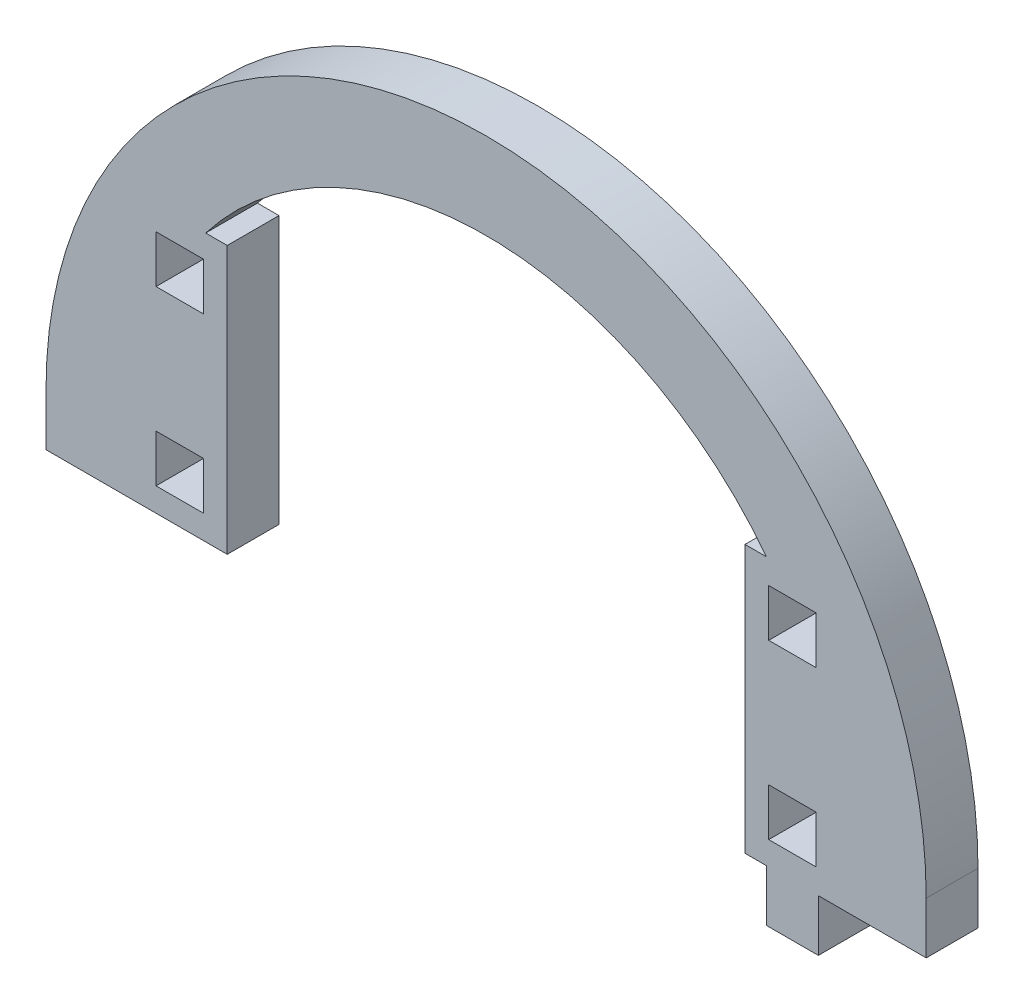
ISO-10303-21;
HEADER;
FILE_DESCRIPTION(('STEP AP214'),'2;1');
FILE_NAME('part.step','',(''),(''),'','','');
FILE_SCHEMA(('AUTOMOTIVE_DESIGN { 1 0 10303 214 1 1 1 1 }'));
ENDSEC;
DATA;
#1=APPLICATION_CONTEXT('core data for automotive mechanical design processes');
#2=APPLICATION_PROTOCOL_DEFINITION('international standard','automotive_design',2000,#1);
#3=PRODUCT_CONTEXT('',#1,'mechanical');
#4=PRODUCT('Part','Part','',(#3));
#5=PRODUCT_RELATED_PRODUCT_CATEGORY('part','',(#4));
#6=PRODUCT_DEFINITION_FORMATION('','',#4);
#7=PRODUCT_DEFINITION_CONTEXT('part definition',#1,'design');
#8=PRODUCT_DEFINITION('design','',#6,#7);
#9=PRODUCT_DEFINITION_SHAPE('','',#8);
#10=(LENGTH_UNIT() NAMED_UNIT(*) SI_UNIT(.MILLI.,.METRE.));
#11=(NAMED_UNIT(*) PLANE_ANGLE_UNIT() SI_UNIT($,.RADIAN.));
#12=(NAMED_UNIT(*) SI_UNIT($,.STERADIAN.) SOLID_ANGLE_UNIT());
#13=UNCERTAINTY_MEASURE_WITH_UNIT(LENGTH_MEASURE(1.E-05),#10,'distance_accuracy_value','');
#14=(GEOMETRIC_REPRESENTATION_CONTEXT(3) GLOBAL_UNCERTAINTY_ASSIGNED_CONTEXT((#13)) GLOBAL_UNIT_ASSIGNED_CONTEXT((#10,
#11,#12)) REPRESENTATION_CONTEXT('',''));
#15=CARTESIAN_POINT('',(0.,0.,0.));
#16=DIRECTION('',(0.,0.,1.));
#17=DIRECTION('',(1.,0.,0.));
#18=AXIS2_PLACEMENT_3D('',#15,#16,#17);
#19=CARTESIAN_POINT('',(3408.03225906087,1716.99435086946,6.));
#20=DIRECTION('',(0.,0.,1.));
#21=DIRECTION('',(1.,0.,0.));
#22=AXIS2_PLACEMENT_3D('',#19,#20,#21);
#23=PLANE('',#22);
#24=DIRECTION('',(0.,-1.,0.));
#25=VECTOR('',#24,1.);
#26=CARTESIAN_POINT('',(3459.03225906087,1716.99435086946,6.));
#27=LINE('',#26,#25);
#28=CARTESIAN_POINT('',(3459.03225906087,1716.99435086946,6.));
#29=VERTEX_POINT('',#28);
#30=CARTESIAN_POINT('',(3459.03225906087,1710.99435086946,6.));
#31=VERTEX_POINT('',#30);
#32=EDGE_CURVE('E643',#29,#31,#27,.T.);
#33=ORIENTED_EDGE('',*,*,#32,.F.);
#34=CARTESIAN_POINT('',(3408.03225906087,1716.99435086946,6.));
#35=DIRECTION('',(0.,0.,1.));
#36=DIRECTION('',(1.,0.,0.));
#37=AXIS2_PLACEMENT_3D('',#34,#35,#36);
#38=CIRCLE('',#37,50.9999999999999);
#39=CARTESIAN_POINT('',(3357.03225906087,1716.99435086946,6.));
#40=VERTEX_POINT('',#39);
#41=EDGE_CURVE('E687',#29,#40,#38,.T.);
#42=ORIENTED_EDGE('',*,*,#41,.T.);
#43=DIRECTION('',(0.,-1.,0.));
#44=VECTOR('',#43,1.);
#45=CARTESIAN_POINT('',(3357.03225906087,1716.99435086946,6.));
#46=LINE('',#45,#44);
#47=CARTESIAN_POINT('',(3357.03225906087,1710.99435086946,6.));
#48=VERTEX_POINT('',#47);
#49=EDGE_CURVE('E683',#40,#48,#46,.T.);
#50=ORIENTED_EDGE('',*,*,#49,.T.);
#51=DIRECTION('',(1.,0.,0.));
#52=VECTOR('',#51,1.);
#53=CARTESIAN_POINT('',(3367.03225906087,1710.99435086946,6.));
#54=LINE('',#53,#52);
#55=CARTESIAN_POINT('',(3378.03225906087,1710.99435086946,6.));
#56=VERTEX_POINT('',#55);
#57=EDGE_CURVE('E680',#48,#56,#54,.T.);
#58=ORIENTED_EDGE('',*,*,#57,.T.);
#59=DIRECTION('',(0.,-1.,0.));
#60=VECTOR('',#59,1.);
#61=CARTESIAN_POINT('',(3378.03225906087,1741.99435086946,6.));
#62=LINE('',#61,#60);
#63=CARTESIAN_POINT('',(3378.03225906087,1741.99435086946,6.));
#64=VERTEX_POINT('',#63);
#65=EDGE_CURVE('E676',#64,#56,#62,.T.);
#66=ORIENTED_EDGE('',*,*,#65,.F.);
#67=DIRECTION('',(-1.,0.,0.));
#68=VECTOR('',#67,1.);
#69=CARTESIAN_POINT('',(3378.03225906087,1741.99435086946,6.));
#70=LINE('',#69,#68);
#71=CARTESIAN_POINT('',(3375.53610544233,1741.99435086946,6.));
#72=VERTEX_POINT('',#71);
#73=EDGE_CURVE('E673',#64,#72,#70,.T.);
#74=ORIENTED_EDGE('',*,*,#73,.T.);
#75=CARTESIAN_POINT('',(3408.03225906087,1716.99435086946,6.));
#76=DIRECTION('',(0.,0.,1.));
#77=DIRECTION('',(1.,0.,0.));
#78=AXIS2_PLACEMENT_3D('',#75,#76,#77);
#79=CIRCLE('',#78,41.);
#80=CARTESIAN_POINT('',(3440.52841267941,1741.99435086946,6.));
#81=VERTEX_POINT('',#80);
#82=EDGE_CURVE('E669',#81,#72,#79,.T.);
#83=ORIENTED_EDGE('',*,*,#82,.F.);
#84=DIRECTION('',(-1.,0.,0.));
#85=VECTOR('',#84,1.);
#86=CARTESIAN_POINT('',(3440.52841267941,1741.99435086946,6.));
#87=LINE('',#86,#85);
#88=CARTESIAN_POINT('',(3438.03225906087,1741.99435086946,6.));
#89=VERTEX_POINT('',#88);
#90=EDGE_CURVE('E666',#81,#89,#87,.T.);
#91=ORIENTED_EDGE('',*,*,#90,.T.);
#92=DIRECTION('',(0.,-1.,0.));
#93=VECTOR('',#92,1.);
#94=CARTESIAN_POINT('',(3438.03225906087,1741.99435086946,6.));
#95=LINE('',#94,#93);
#96=CARTESIAN_POINT('',(3438.03225906087,1710.99435086946,6.));
#97=VERTEX_POINT('',#96);
#98=EDGE_CURVE('E663',#89,#97,#95,.T.);
#99=ORIENTED_EDGE('',*,*,#98,.T.);
#100=DIRECTION('',(1.,0.,0.));
#101=VECTOR('',#100,1.);
#102=CARTESIAN_POINT('',(3438.03225906087,1710.99435086946,6.));
#103=LINE('',#102,#101);
#104=CARTESIAN_POINT('',(3440.53225906087,1710.99435086946,6.));
#105=VERTEX_POINT('',#104);
#106=EDGE_CURVE('E660',#97,#105,#103,.T.);
#107=ORIENTED_EDGE('',*,*,#106,.T.);
#108=DIRECTION('',(0.,-1.,0.));
#109=VECTOR('',#108,1.);
#110=CARTESIAN_POINT('',(3440.53225906087,1710.99435086946,6.));
#111=LINE('',#110,#109);
#112=CARTESIAN_POINT('',(3440.53225906087,1704.99435086946,6.));
#113=VERTEX_POINT('',#112);
#114=EDGE_CURVE('E657',#105,#113,#111,.T.);
#115=ORIENTED_EDGE('',*,*,#114,.T.);
#116=DIRECTION('',(1.,0.,0.));
#117=VECTOR('',#116,1.);
#118=CARTESIAN_POINT('',(3440.53225906087,1704.99435086946,6.));
#119=LINE('',#118,#117);
#120=CARTESIAN_POINT('',(3446.53225906087,1704.99435086946,6.));
#121=VERTEX_POINT('',#120);
#122=EDGE_CURVE('E654',#113,#121,#119,.T.);
#123=ORIENTED_EDGE('',*,*,#122,.T.);
#124=DIRECTION('',(0.,1.,0.));
#125=VECTOR('',#124,1.);
#126=CARTESIAN_POINT('',(3446.53225906087,1704.99435086946,6.));
#127=LINE('',#126,#125);
#128=CARTESIAN_POINT('',(3446.53225906087,1710.99435086946,6.));
#129=VERTEX_POINT('',#128);
#130=EDGE_CURVE('E651',#121,#129,#127,.T.);
#131=ORIENTED_EDGE('',*,*,#130,.T.);
#132=DIRECTION('',(1.,0.,0.));
#133=VECTOR('',#132,1.);
#134=CARTESIAN_POINT('',(3446.53225906087,1710.99435086946,6.));
#135=LINE('',#134,#133);
#136=EDGE_CURVE('E647',#129,#31,#135,.T.);
#137=ORIENTED_EDGE('',*,*,#136,.T.);
#138=EDGE_LOOP('',(#33,#42,#50,#58,#66,#74,#83,#91,#99,#107,#115,#123,#131,#137));
#139=FACE_BOUND('',#138,.T.);
#140=DIRECTION('',(0.,1.,0.));
#141=VECTOR('',#140,1.);
#142=CARTESIAN_POINT('',(3375.28225906087,0.,6.));
#143=LINE('',#142,#141);
#144=CARTESIAN_POINT('',(3375.28225906087,1713.74435086946,6.));
#145=VERTEX_POINT('',#144);
#146=CARTESIAN_POINT('',(3375.28225906087,1719.24435086946,6.));
#147=VERTEX_POINT('',#146);
#148=EDGE_CURVE('E603',#145,#147,#143,.T.);
#149=ORIENTED_EDGE('',*,*,#148,.F.);
#150=DIRECTION('',(1.,0.,0.));
#151=VECTOR('',#150,1.);
#152=CARTESIAN_POINT('',(0.,1713.74435086946,6.));
#153=LINE('',#152,#151);
#154=CARTESIAN_POINT('',(3369.78225906087,1713.74435086946,6.));
#155=VERTEX_POINT('',#154);
#156=EDGE_CURVE('E600',#155,#145,#153,.T.);
#157=ORIENTED_EDGE('',*,*,#156,.F.);
#158=DIRECTION('',(0.,-1.,0.));
#159=VECTOR('',#158,1.);
#160=CARTESIAN_POINT('',(3369.78225906087,0.,6.));
#161=LINE('',#160,#159);
#162=CARTESIAN_POINT('',(3369.78225906087,1719.24435086946,6.));
#163=VERTEX_POINT('',#162);
#164=EDGE_CURVE('E611',#163,#155,#161,.T.);
#165=ORIENTED_EDGE('',*,*,#164,.F.);
#166=DIRECTION('',(-1.,0.,0.));
#167=VECTOR('',#166,1.);
#168=CARTESIAN_POINT('',(0.,1719.24435086946,6.));
#169=LINE('',#168,#167);
#170=EDGE_CURVE('E607',#147,#163,#169,.T.);
#171=ORIENTED_EDGE('',*,*,#170,.F.);
#172=EDGE_LOOP('',(#149,#157,#165,#171));
#173=FACE_BOUND('',#172,.T.);
#174=DIRECTION('',(0.,1.,0.));
#175=VECTOR('',#174,1.);
#176=CARTESIAN_POINT('',(3446.28225906087,0.,6.));
#177=LINE('',#176,#175);
#178=CARTESIAN_POINT('',(3446.28225906087,1733.74435086946,6.));
#179=VERTEX_POINT('',#178);
#180=CARTESIAN_POINT('',(3446.28225906087,1739.24435086946,6.));
#181=VERTEX_POINT('',#180);
#182=EDGE_CURVE('E560',#179,#181,#177,.T.);
#183=ORIENTED_EDGE('',*,*,#182,.F.);
#184=DIRECTION('',(1.,0.,0.));
#185=VECTOR('',#184,1.);
#186=CARTESIAN_POINT('',(0.,1733.74435086946,6.));
#187=LINE('',#186,#185);
#188=CARTESIAN_POINT('',(3440.78225906087,1733.74435086946,6.));
#189=VERTEX_POINT('',#188);
#190=EDGE_CURVE('E557',#189,#179,#187,.T.);
#191=ORIENTED_EDGE('',*,*,#190,.F.);
#192=DIRECTION('',(0.,-1.,0.));
#193=VECTOR('',#192,1.);
#194=CARTESIAN_POINT('',(3440.78225906087,0.,6.));
#195=LINE('',#194,#193);
#196=CARTESIAN_POINT('',(3440.78225906087,1739.24435086946,6.));
#197=VERTEX_POINT('',#196);
#198=EDGE_CURVE('E568',#197,#189,#195,.T.);
#199=ORIENTED_EDGE('',*,*,#198,.F.);
#200=DIRECTION('',(-1.,0.,0.));
#201=VECTOR('',#200,1.);
#202=CARTESIAN_POINT('',(0.,1739.24435086946,6.));
#203=LINE('',#202,#201);
#204=EDGE_CURVE('E564',#181,#197,#203,.T.);
#205=ORIENTED_EDGE('',*,*,#204,.F.);
#206=EDGE_LOOP('',(#183,#191,#199,#205));
#207=FACE_BOUND('',#206,.T.);
#208=DIRECTION('',(0.,1.,0.));
#209=VECTOR('',#208,1.);
#210=CARTESIAN_POINT('',(3446.28225906087,0.,6.));
#211=LINE('',#210,#209);
#212=CARTESIAN_POINT('',(3446.28225906087,1713.74435086946,6.));
#213=VERTEX_POINT('',#212);
#214=CARTESIAN_POINT('',(3446.28225906087,1719.24435086946,6.));
#215=VERTEX_POINT('',#214);
#216=EDGE_CURVE('E517',#213,#215,#211,.T.);
#217=ORIENTED_EDGE('',*,*,#216,.F.);
#218=DIRECTION('',(1.,0.,0.));
#219=VECTOR('',#218,1.);
#220=CARTESIAN_POINT('',(0.,1713.74435086946,6.));
#221=LINE('',#220,#219);
#222=CARTESIAN_POINT('',(3440.78225906087,1713.74435086946,6.));
#223=VERTEX_POINT('',#222);
#224=EDGE_CURVE('E514',#223,#213,#221,.T.);
#225=ORIENTED_EDGE('',*,*,#224,.F.);
#226=DIRECTION('',(0.,-1.,0.));
#227=VECTOR('',#226,1.);
#228=CARTESIAN_POINT('',(3440.78225906087,0.,6.));
#229=LINE('',#228,#227);
#230=CARTESIAN_POINT('',(3440.78225906087,1719.24435086946,6.));
#231=VERTEX_POINT('',#230);
#232=EDGE_CURVE('E525',#231,#223,#229,.T.);
#233=ORIENTED_EDGE('',*,*,#232,.F.);
#234=DIRECTION('',(-1.,0.,0.));
#235=VECTOR('',#234,1.);
#236=CARTESIAN_POINT('',(0.,1719.24435086946,6.));
#237=LINE('',#236,#235);
#238=EDGE_CURVE('E521',#215,#231,#237,.T.);
#239=ORIENTED_EDGE('',*,*,#238,.F.);
#240=EDGE_LOOP('',(#217,#225,#233,#239));
#241=FACE_BOUND('',#240,.T.);
#242=DIRECTION('',(0.,-1.,0.));
#243=VECTOR('',#242,1.);
#244=CARTESIAN_POINT('',(3369.78225906087,1739.24435086946,6.));
#245=LINE('',#244,#243);
#246=CARTESIAN_POINT('',(3369.78225906087,1739.24435086946,6.));
#247=VERTEX_POINT('',#246);
#248=CARTESIAN_POINT('',(3369.78225906087,1733.74435086946,6.));
#249=VERTEX_POINT('',#248);
#250=EDGE_CURVE('E475',#247,#249,#245,.T.);
#251=ORIENTED_EDGE('',*,*,#250,.F.);
#252=DIRECTION('',(-1.,0.,0.));
#253=VECTOR('',#252,1.);
#254=CARTESIAN_POINT('',(3375.28225906087,1739.24435086946,6.));
#255=LINE('',#254,#253);
#256=CARTESIAN_POINT('',(3375.28225906087,1739.24435086946,6.));
#257=VERTEX_POINT('',#256);
#258=EDGE_CURVE('E466',#257,#247,#255,.T.);
#259=ORIENTED_EDGE('',*,*,#258,.F.);
#260=DIRECTION('',(0.,1.,0.));
#261=VECTOR('',#260,1.);
#262=CARTESIAN_POINT('',(3375.28225906087,1733.74435086946,6.));
#263=LINE('',#262,#261);
#264=CARTESIAN_POINT('',(3375.28225906087,1733.74435086946,6.));
#265=VERTEX_POINT('',#264);
#266=EDGE_CURVE('E492',#265,#257,#263,.T.);
#267=ORIENTED_EDGE('',*,*,#266,.F.);
#268=DIRECTION('',(1.,0.,0.));
#269=VECTOR('',#268,1.);
#270=CARTESIAN_POINT('',(3369.78225906087,1733.74435086946,6.));
#271=LINE('',#270,#269);
#272=EDGE_CURVE('E488',#249,#265,#271,.T.);
#273=ORIENTED_EDGE('',*,*,#272,.F.);
#274=EDGE_LOOP('',(#251,#259,#267,#273));
#275=FACE_BOUND('',#274,.T.);
#276=ADVANCED_FACE('F267',(#139,#173,#207,#241,#275),#23,.T.);
#277=CARTESIAN_POINT('',(3408.03225906087,1716.99435086946,0.));
#278=DIRECTION('',(0.,0.,1.));
#279=DIRECTION('',(1.,0.,0.));
#280=AXIS2_PLACEMENT_3D('',#277,#278,#279);
#281=PLANE('',#280);
#282=DIRECTION('',(1.,0.,0.));
#283=VECTOR('',#282,1.);
#284=CARTESIAN_POINT('',(0.,1713.74435086946,0.));
#285=LINE('',#284,#283);
#286=CARTESIAN_POINT('',(3440.78225906087,1713.74435086946,0.));
#287=VERTEX_POINT('',#286);
#288=CARTESIAN_POINT('',(3446.28225906087,1713.74435086946,0.));
#289=VERTEX_POINT('',#288);
#290=EDGE_CURVE('E484',#287,#289,#285,.T.);
#291=ORIENTED_EDGE('',*,*,#290,.T.);
#292=DIRECTION('',(0.,1.,0.));
#293=VECTOR('',#292,1.);
#294=CARTESIAN_POINT('',(3446.28225906087,0.,0.));
#295=LINE('',#294,#293);
#296=CARTESIAN_POINT('',(3446.28225906087,1719.24435086946,0.));
#297=VERTEX_POINT('',#296);
#298=EDGE_CURVE('E532',#289,#297,#295,.T.);
#299=ORIENTED_EDGE('',*,*,#298,.T.);
#300=DIRECTION('',(-1.,0.,0.));
#301=VECTOR('',#300,1.);
#302=CARTESIAN_POINT('',(0.,1719.24435086946,0.));
#303=LINE('',#302,#301);
#304=CARTESIAN_POINT('',(3440.78225906087,1719.24435086946,0.));
#305=VERTEX_POINT('',#304);
#306=EDGE_CURVE('E536',#297,#305,#303,.T.);
#307=ORIENTED_EDGE('',*,*,#306,.T.);
#308=DIRECTION('',(0.,-1.,0.));
#309=VECTOR('',#308,1.);
#310=CARTESIAN_POINT('',(3440.78225906087,0.,0.));
#311=LINE('',#310,#309);
#312=EDGE_CURVE('E518',#305,#287,#311,.T.);
#313=ORIENTED_EDGE('',*,*,#312,.T.);
#314=EDGE_LOOP('',(#291,#299,#307,#313));
#315=FACE_BOUND('',#314,.T.);
#316=DIRECTION('',(1.,0.,0.));
#317=VECTOR('',#316,1.);
#318=CARTESIAN_POINT('',(0.,1713.74435086946,0.));
#319=LINE('',#318,#317);
#320=CARTESIAN_POINT('',(3369.78225906087,1713.74435086946,0.));
#321=VERTEX_POINT('',#320);
#322=CARTESIAN_POINT('',(3375.28225906087,1713.74435086946,0.));
#323=VERTEX_POINT('',#322);
#324=EDGE_CURVE('E599',#321,#323,#319,.T.);
#325=ORIENTED_EDGE('',*,*,#324,.T.);
#326=DIRECTION('',(0.,1.,0.));
#327=VECTOR('',#326,1.);
#328=CARTESIAN_POINT('',(3375.28225906087,0.,0.));
#329=LINE('',#328,#327);
#330=CARTESIAN_POINT('',(3375.28225906087,1719.24435086946,0.));
#331=VERTEX_POINT('',#330);
#332=EDGE_CURVE('E618',#323,#331,#329,.T.);
#333=ORIENTED_EDGE('',*,*,#332,.T.);
#334=DIRECTION('',(-1.,0.,0.));
#335=VECTOR('',#334,1.);
#336=CARTESIAN_POINT('',(0.,1719.24435086946,0.));
#337=LINE('',#336,#335);
#338=CARTESIAN_POINT('',(3369.78225906087,1719.24435086946,0.));
#339=VERTEX_POINT('',#338);
#340=EDGE_CURVE('E622',#331,#339,#337,.T.);
#341=ORIENTED_EDGE('',*,*,#340,.T.);
#342=DIRECTION('',(0.,-1.,0.));
#343=VECTOR('',#342,1.);
#344=CARTESIAN_POINT('',(3369.78225906087,0.,0.));
#345=LINE('',#344,#343);
#346=EDGE_CURVE('E604',#339,#321,#345,.T.);
#347=ORIENTED_EDGE('',*,*,#346,.T.);
#348=EDGE_LOOP('',(#325,#333,#341,#347));
#349=FACE_BOUND('',#348,.T.);
#350=DIRECTION('',(0.,-1.,0.));
#351=VECTOR('',#350,1.);
#352=CARTESIAN_POINT('',(3459.03225906087,1716.99435086946,0.));
#353=LINE('',#352,#351);
#354=CARTESIAN_POINT('',(3459.03225906087,1716.99435086946,0.));
#355=VERTEX_POINT('',#354);
#356=CARTESIAN_POINT('',(3459.03225906087,1710.99435086946,0.));
#357=VERTEX_POINT('',#356);
#358=EDGE_CURVE('E642',#355,#357,#353,.T.);
#359=ORIENTED_EDGE('',*,*,#358,.T.);
#360=DIRECTION('',(1.,0.,0.));
#361=VECTOR('',#360,1.);
#362=CARTESIAN_POINT('',(3446.53225906087,1710.99435086946,0.));
#363=LINE('',#362,#361);
#364=CARTESIAN_POINT('',(3446.53225906087,1710.99435086946,0.));
#365=VERTEX_POINT('',#364);
#366=EDGE_CURVE('E693',#365,#357,#363,.T.);
#367=ORIENTED_EDGE('',*,*,#366,.F.);
#368=DIRECTION('',(0.,1.,0.));
#369=VECTOR('',#368,1.);
#370=CARTESIAN_POINT('',(3446.53225906087,1704.99435086946,0.));
#371=LINE('',#370,#369);
#372=CARTESIAN_POINT('',(3446.53225906087,1704.99435086946,0.));
#373=VERTEX_POINT('',#372);
#374=EDGE_CURVE('E697',#373,#365,#371,.T.);
#375=ORIENTED_EDGE('',*,*,#374,.F.);
#376=DIRECTION('',(1.,0.,0.));
#377=VECTOR('',#376,1.);
#378=CARTESIAN_POINT('',(3440.53225906087,1704.99435086946,0.));
#379=LINE('',#378,#377);
#380=CARTESIAN_POINT('',(3440.53225906087,1704.99435086946,0.));
#381=VERTEX_POINT('',#380);
#382=EDGE_CURVE('E700',#381,#373,#379,.T.);
#383=ORIENTED_EDGE('',*,*,#382,.F.);
#384=DIRECTION('',(0.,-1.,0.));
#385=VECTOR('',#384,1.);
#386=CARTESIAN_POINT('',(3440.53225906087,1710.99435086946,0.));
#387=LINE('',#386,#385);
#388=CARTESIAN_POINT('',(3440.53225906087,1710.99435086946,0.));
#389=VERTEX_POINT('',#388);
#390=EDGE_CURVE('E703',#389,#381,#387,.T.);
#391=ORIENTED_EDGE('',*,*,#390,.F.);
#392=DIRECTION('',(1.,0.,0.));
#393=VECTOR('',#392,1.);
#394=CARTESIAN_POINT('',(3438.03225906087,1710.99435086946,0.));
#395=LINE('',#394,#393);
#396=CARTESIAN_POINT('',(3438.03225906087,1710.99435086946,0.));
#397=VERTEX_POINT('',#396);
#398=EDGE_CURVE('E706',#397,#389,#395,.T.);
#399=ORIENTED_EDGE('',*,*,#398,.F.);
#400=DIRECTION('',(0.,-1.,0.));
#401=VECTOR('',#400,1.);
#402=CARTESIAN_POINT('',(3438.03225906087,1741.99435086946,0.));
#403=LINE('',#402,#401);
#404=CARTESIAN_POINT('',(3438.03225906087,1741.99435086946,0.));
#405=VERTEX_POINT('',#404);
#406=EDGE_CURVE('E709',#405,#397,#403,.T.);
#407=ORIENTED_EDGE('',*,*,#406,.F.);
#408=DIRECTION('',(-1.,0.,0.));
#409=VECTOR('',#408,1.);
#410=CARTESIAN_POINT('',(3440.52841267941,1741.99435086946,0.));
#411=LINE('',#410,#409);
#412=CARTESIAN_POINT('',(3440.52841267941,1741.99435086946,0.));
#413=VERTEX_POINT('',#412);
#414=EDGE_CURVE('E712',#413,#405,#411,.T.);
#415=ORIENTED_EDGE('',*,*,#414,.F.);
#416=CARTESIAN_POINT('',(3408.03225906087,1716.99435086946,0.));
#417=DIRECTION('',(0.,0.,1.));
#418=DIRECTION('',(1.,0.,0.));
#419=AXIS2_PLACEMENT_3D('',#416,#417,#418);
#420=CIRCLE('',#419,41.);
#421=CARTESIAN_POINT('',(3375.53610544233,1741.99435086946,0.));
#422=VERTEX_POINT('',#421);
#423=EDGE_CURVE('E715',#413,#422,#420,.T.);
#424=ORIENTED_EDGE('',*,*,#423,.T.);
#425=DIRECTION('',(-1.,0.,0.));
#426=VECTOR('',#425,1.);
#427=CARTESIAN_POINT('',(3378.03225906087,1741.99435086946,0.));
#428=LINE('',#427,#426);
#429=CARTESIAN_POINT('',(3378.03225906087,1741.99435086946,0.));
#430=VERTEX_POINT('',#429);
#431=EDGE_CURVE('E719',#430,#422,#428,.T.);
#432=ORIENTED_EDGE('',*,*,#431,.F.);
#433=DIRECTION('',(0.,-1.,0.));
#434=VECTOR('',#433,1.);
#435=CARTESIAN_POINT('',(3378.03225906087,1741.99435086946,0.));
#436=LINE('',#435,#434);
#437=CARTESIAN_POINT('',(3378.03225906087,1710.99435086946,0.));
#438=VERTEX_POINT('',#437);
#439=EDGE_CURVE('E723',#430,#438,#436,.T.);
#440=ORIENTED_EDGE('',*,*,#439,.T.);
#441=DIRECTION('',(-1.,0.,0.));
#442=VECTOR('',#441,1.);
#443=CARTESIAN_POINT('',(3367.03225906087,1710.99435086946,0.));
#444=LINE('',#443,#442);
#445=CARTESIAN_POINT('',(3357.03225906087,1710.99435086946,0.));
#446=VERTEX_POINT('',#445);
#447=EDGE_CURVE('E727',#438,#446,#444,.T.);
#448=ORIENTED_EDGE('',*,*,#447,.T.);
#449=DIRECTION('',(0.,-1.,0.));
#450=VECTOR('',#449,1.);
#451=CARTESIAN_POINT('',(3357.03225906087,1716.99435086946,0.));
#452=LINE('',#451,#450);
#453=CARTESIAN_POINT('',(3357.03225906087,1716.99435086946,0.));
#454=VERTEX_POINT('',#453);
#455=EDGE_CURVE('E731',#454,#446,#452,.T.);
#456=ORIENTED_EDGE('',*,*,#455,.F.);
#457=CARTESIAN_POINT('',(3408.03225906087,1716.99435086946,0.));
#458=DIRECTION('',(0.,0.,1.));
#459=DIRECTION('',(1.,0.,0.));
#460=AXIS2_PLACEMENT_3D('',#457,#458,#459);
#461=CIRCLE('',#460,50.9999999999999);
#462=EDGE_CURVE('E648',#355,#454,#461,.T.);
#463=ORIENTED_EDGE('',*,*,#462,.F.);
#464=EDGE_LOOP('',(#359,#367,#375,#383,#391,#399,#407,#415,#424,#432,#440,#448,#456,#463));
#465=FACE_BOUND('',#464,.T.);
#466=DIRECTION('',(1.,0.,0.));
#467=VECTOR('',#466,1.);
#468=CARTESIAN_POINT('',(0.,1733.74435086946,0.));
#469=LINE('',#468,#467);
#470=CARTESIAN_POINT('',(3440.78225906087,1733.74435086946,0.));
#471=VERTEX_POINT('',#470);
#472=CARTESIAN_POINT('',(3446.28225906087,1733.74435086946,0.));
#473=VERTEX_POINT('',#472);
#474=EDGE_CURVE('E556',#471,#473,#469,.T.);
#475=ORIENTED_EDGE('',*,*,#474,.T.);
#476=DIRECTION('',(0.,1.,0.));
#477=VECTOR('',#476,1.);
#478=CARTESIAN_POINT('',(3446.28225906087,0.,0.));
#479=LINE('',#478,#477);
#480=CARTESIAN_POINT('',(3446.28225906087,1739.24435086946,0.));
#481=VERTEX_POINT('',#480);
#482=EDGE_CURVE('E575',#473,#481,#479,.T.);
#483=ORIENTED_EDGE('',*,*,#482,.T.);
#484=DIRECTION('',(-1.,0.,0.));
#485=VECTOR('',#484,1.);
#486=CARTESIAN_POINT('',(0.,1739.24435086946,0.));
#487=LINE('',#486,#485);
#488=CARTESIAN_POINT('',(3440.78225906087,1739.24435086946,0.));
#489=VERTEX_POINT('',#488);
#490=EDGE_CURVE('E579',#481,#489,#487,.T.);
#491=ORIENTED_EDGE('',*,*,#490,.T.);
#492=DIRECTION('',(0.,-1.,0.));
#493=VECTOR('',#492,1.);
#494=CARTESIAN_POINT('',(3440.78225906087,0.,0.));
#495=LINE('',#494,#493);
#496=EDGE_CURVE('E561',#489,#471,#495,.T.);
#497=ORIENTED_EDGE('',*,*,#496,.T.);
#498=EDGE_LOOP('',(#475,#483,#491,#497));
#499=FACE_BOUND('',#498,.T.);
#500=DIRECTION('',(-1.,0.,0.));
#501=VECTOR('',#500,1.);
#502=CARTESIAN_POINT('',(3375.28225906087,1739.24435086946,0.));
#503=LINE('',#502,#501);
#504=CARTESIAN_POINT('',(3375.28225906087,1739.24435086946,0.));
#505=VERTEX_POINT('',#504);
#506=CARTESIAN_POINT('',(3369.78225906087,1739.24435086946,0.));
#507=VERTEX_POINT('',#506);
#508=EDGE_CURVE('E293',#505,#507,#503,.T.);
#509=ORIENTED_EDGE('',*,*,#508,.T.);
#510=DIRECTION('',(0.,-1.,0.));
#511=VECTOR('',#510,1.);
#512=CARTESIAN_POINT('',(3369.78225906087,1739.24435086946,0.));
#513=LINE('',#512,#511);
#514=CARTESIAN_POINT('',(3369.78225906087,1733.74435086946,0.));
#515=VERTEX_POINT('',#514);
#516=EDGE_CURVE('E482',#507,#515,#513,.T.);
#517=ORIENTED_EDGE('',*,*,#516,.T.);
#518=DIRECTION('',(1.,0.,0.));
#519=VECTOR('',#518,1.);
#520=CARTESIAN_POINT('',(3369.78225906087,1733.74435086946,0.));
#521=LINE('',#520,#519);
#522=CARTESIAN_POINT('',(3375.28225906087,1733.74435086946,0.));
#523=VERTEX_POINT('',#522);
#524=EDGE_CURVE('E501',#515,#523,#521,.T.);
#525=ORIENTED_EDGE('',*,*,#524,.T.);
#526=DIRECTION('',(0.,1.,0.));
#527=VECTOR('',#526,1.);
#528=CARTESIAN_POINT('',(3375.28225906087,1733.74435086946,0.));
#529=LINE('',#528,#527);
#530=EDGE_CURVE('E476',#523,#505,#529,.T.);
#531=ORIENTED_EDGE('',*,*,#530,.T.);
#532=EDGE_LOOP('',(#509,#517,#525,#531));
#533=FACE_BOUND('',#532,.T.);
#534=ADVANCED_FACE('F791',(#315,#349,#465,#499,#533),#281,.F.);
#535=CARTESIAN_POINT('',(3459.03225906087,1716.99435086946,6.));
#536=DIRECTION('',(1.,0.,0.));
#537=DIRECTION('',(0.,0.,-1.));
#538=AXIS2_PLACEMENT_3D('',#535,#536,#537);
#539=PLANE('',#538);
#540=ORIENTED_EDGE('',*,*,#358,.F.);
#541=DIRECTION('',(0.,0.,-1.));
#542=VECTOR('',#541,1.);
#543=CARTESIAN_POINT('',(3459.03225906087,1716.99435086946,6.));
#544=LINE('',#543,#542);
#545=EDGE_CURVE('E12',#29,#355,#544,.T.);
#546=ORIENTED_EDGE('',*,*,#545,.F.);
#547=ORIENTED_EDGE('',*,*,#32,.T.);
#548=DIRECTION('',(0.,0.,-1.));
#549=VECTOR('',#548,1.);
#550=CARTESIAN_POINT('',(3459.03225906087,1710.99435086946,6.));
#551=LINE('',#550,#549);
#552=EDGE_CURVE('E271',#31,#357,#551,.T.);
#553=ORIENTED_EDGE('',*,*,#552,.T.);
#554=EDGE_LOOP('',(#540,#546,#547,#553));
#555=FACE_BOUND('',#554,.T.);
#556=ADVANCED_FACE('F269',(#555),#539,.T.);
#557=CARTESIAN_POINT('',(3408.03225906087,1716.99435086946,6.));
#558=DIRECTION('',(0.,0.,-1.));
#559=DIRECTION('',(-1.,0.,0.));
#560=AXIS2_PLACEMENT_3D('',#557,#558,#559);
#561=CYLINDRICAL_SURFACE('',#560,50.9999999999999);
#562=ORIENTED_EDGE('',*,*,#462,.T.);
#563=DIRECTION('',(0.,0.,-1.));
#564=VECTOR('',#563,1.);
#565=CARTESIAN_POINT('',(3357.03225906087,1716.99435086946,6.));
#566=LINE('',#565,#564);
#567=EDGE_CURVE('E277',#40,#454,#566,.T.);
#568=ORIENTED_EDGE('',*,*,#567,.F.);
#569=ORIENTED_EDGE('',*,*,#41,.F.);
#570=ORIENTED_EDGE('',*,*,#545,.T.);
#571=EDGE_LOOP('',(#562,#568,#569,#570));
#572=FACE_BOUND('',#571,.T.);
#573=ADVANCED_FACE('F796',(#572),#561,.T.);
#574=CARTESIAN_POINT('',(3357.03225906087,1716.99435086946,6.));
#575=DIRECTION('',(1.,0.,0.));
#576=DIRECTION('',(0.,0.,-1.));
#577=AXIS2_PLACEMENT_3D('',#574,#575,#576);
#578=PLANE('',#577);
#579=ORIENTED_EDGE('',*,*,#455,.T.);
#580=DIRECTION('',(0.,0.,-1.));
#581=VECTOR('',#580,1.);
#582=CARTESIAN_POINT('',(3357.03225906087,1710.99435086946,6.));
#583=LINE('',#582,#581);
#584=EDGE_CURVE('E740',#48,#446,#583,.T.);
#585=ORIENTED_EDGE('',*,*,#584,.F.);
#586=ORIENTED_EDGE('',*,*,#49,.F.);
#587=ORIENTED_EDGE('',*,*,#567,.T.);
#588=EDGE_LOOP('',(#579,#585,#586,#587));
#589=FACE_BOUND('',#588,.T.);
#590=ADVANCED_FACE('F800',(#589),#578,.F.);
#591=CARTESIAN_POINT('',(3367.03225906087,1710.99435086946,6.));
#592=DIRECTION('',(0.,-1.,0.));
#593=DIRECTION('',(0.,0.,-1.));
#594=AXIS2_PLACEMENT_3D('',#591,#592,#593);
#595=PLANE('',#594);
#596=ORIENTED_EDGE('',*,*,#447,.F.);
#597=DIRECTION('',(0.,0.,-1.));
#598=VECTOR('',#597,1.);
#599=CARTESIAN_POINT('',(3378.03225906087,1710.99435086946,6.));
#600=LINE('',#599,#598);
#601=EDGE_CURVE('E743',#56,#438,#600,.T.);
#602=ORIENTED_EDGE('',*,*,#601,.F.);
#603=ORIENTED_EDGE('',*,*,#57,.F.);
#604=ORIENTED_EDGE('',*,*,#584,.T.);
#605=EDGE_LOOP('',(#596,#602,#603,#604));
#606=FACE_BOUND('',#605,.T.);
#607=ADVANCED_FACE('F846',(#606),#595,.T.);
#608=CARTESIAN_POINT('',(3378.03225906087,1741.99435086946,6.));
#609=DIRECTION('',(1.,0.,0.));
#610=DIRECTION('',(0.,0.,-1.));
#611=AXIS2_PLACEMENT_3D('',#608,#609,#610);
#612=PLANE('',#611);
#613=ORIENTED_EDGE('',*,*,#439,.F.);
#614=DIRECTION('',(0.,0.,-1.));
#615=VECTOR('',#614,1.);
#616=CARTESIAN_POINT('',(3378.03225906087,1741.99435086946,6.));
#617=LINE('',#616,#615);
#618=EDGE_CURVE('E747',#64,#430,#617,.T.);
#619=ORIENTED_EDGE('',*,*,#618,.F.);
#620=ORIENTED_EDGE('',*,*,#65,.T.);
#621=ORIENTED_EDGE('',*,*,#601,.T.);
#622=EDGE_LOOP('',(#613,#619,#620,#621));
#623=FACE_BOUND('',#622,.T.);
#624=ADVANCED_FACE('F843',(#623),#612,.T.);
#625=CARTESIAN_POINT('',(3378.03225906087,1741.99435086946,6.));
#626=DIRECTION('',(0.,-1.,0.));
#627=DIRECTION('',(0.,0.,-1.));
#628=AXIS2_PLACEMENT_3D('',#625,#626,#627);
#629=PLANE('',#628);
#630=ORIENTED_EDGE('',*,*,#431,.T.);
#631=DIRECTION('',(0.,0.,-1.));
#632=VECTOR('',#631,1.);
#633=CARTESIAN_POINT('',(3375.53610544233,1741.99435086946,6.));
#634=LINE('',#633,#632);
#635=EDGE_CURVE('E750',#72,#422,#634,.T.);
#636=ORIENTED_EDGE('',*,*,#635,.F.);
#637=ORIENTED_EDGE('',*,*,#73,.F.);
#638=ORIENTED_EDGE('',*,*,#618,.T.);
#639=EDGE_LOOP('',(#630,#636,#637,#638));
#640=FACE_BOUND('',#639,.T.);
#641=ADVANCED_FACE('F853',(#640),#629,.F.);
#642=CARTESIAN_POINT('',(3408.03225906087,1716.99435086946,6.));
#643=DIRECTION('',(0.,0.,-1.));
#644=DIRECTION('',(-1.,0.,0.));
#645=AXIS2_PLACEMENT_3D('',#642,#643,#644);
#646=CYLINDRICAL_SURFACE('',#645,41.);
#647=ORIENTED_EDGE('',*,*,#423,.F.);
#648=DIRECTION('',(0.,0.,-1.));
#649=VECTOR('',#648,1.);
#650=CARTESIAN_POINT('',(3440.52841267941,1741.99435086946,6.));
#651=LINE('',#650,#649);
#652=EDGE_CURVE('E753',#81,#413,#651,.T.);
#653=ORIENTED_EDGE('',*,*,#652,.F.);
#654=ORIENTED_EDGE('',*,*,#82,.T.);
#655=ORIENTED_EDGE('',*,*,#635,.T.);
#656=EDGE_LOOP('',(#647,#653,#654,#655));
#657=FACE_BOUND('',#656,.T.);
#658=ADVANCED_FACE('F837',(#657),#646,.F.);
#659=CARTESIAN_POINT('',(3440.52841267941,1741.99435086946,6.));
#660=DIRECTION('',(0.,-1.,0.));
#661=DIRECTION('',(0.,0.,-1.));
#662=AXIS2_PLACEMENT_3D('',#659,#660,#661);
#663=PLANE('',#662);
#664=ORIENTED_EDGE('',*,*,#414,.T.);
#665=DIRECTION('',(0.,0.,-1.));
#666=VECTOR('',#665,1.);
#667=CARTESIAN_POINT('',(3438.03225906087,1741.99435086946,6.));
#668=LINE('',#667,#666);
#669=EDGE_CURVE('E756',#89,#405,#668,.T.);
#670=ORIENTED_EDGE('',*,*,#669,.F.);
#671=ORIENTED_EDGE('',*,*,#90,.F.);
#672=ORIENTED_EDGE('',*,*,#652,.T.);
#673=EDGE_LOOP('',(#664,#670,#671,#672));
#674=FACE_BOUND('',#673,.T.);
#675=ADVANCED_FACE('F834',(#674),#663,.F.);
#676=CARTESIAN_POINT('',(3438.03225906087,1741.99435086946,6.));
#677=DIRECTION('',(1.,0.,0.));
#678=DIRECTION('',(0.,0.,-1.));
#679=AXIS2_PLACEMENT_3D('',#676,#677,#678);
#680=PLANE('',#679);
#681=ORIENTED_EDGE('',*,*,#406,.T.);
#682=DIRECTION('',(0.,0.,-1.));
#683=VECTOR('',#682,1.);
#684=CARTESIAN_POINT('',(3438.03225906087,1710.99435086946,6.));
#685=LINE('',#684,#683);
#686=EDGE_CURVE('E760',#97,#397,#685,.T.);
#687=ORIENTED_EDGE('',*,*,#686,.F.);
#688=ORIENTED_EDGE('',*,*,#98,.F.);
#689=ORIENTED_EDGE('',*,*,#669,.T.);
#690=EDGE_LOOP('',(#681,#687,#688,#689));
#691=FACE_BOUND('',#690,.T.);
#692=ADVANCED_FACE('F829',(#691),#680,.F.);
#693=CARTESIAN_POINT('',(3438.03225906087,1710.99435086946,6.));
#694=DIRECTION('',(0.,1.,0.));
#695=DIRECTION('',(0.,0.,1.));
#696=AXIS2_PLACEMENT_3D('',#693,#694,#695);
#697=PLANE('',#696);
#698=ORIENTED_EDGE('',*,*,#398,.T.);
#699=DIRECTION('',(0.,0.,-1.));
#700=VECTOR('',#699,1.);
#701=CARTESIAN_POINT('',(3440.53225906087,1710.99435086946,6.));
#702=LINE('',#701,#700);
#703=EDGE_CURVE('E764',#105,#389,#702,.T.);
#704=ORIENTED_EDGE('',*,*,#703,.F.);
#705=ORIENTED_EDGE('',*,*,#106,.F.);
#706=ORIENTED_EDGE('',*,*,#686,.T.);
#707=EDGE_LOOP('',(#698,#704,#705,#706));
#708=FACE_BOUND('',#707,.T.);
#709=ADVANCED_FACE('F823',(#708),#697,.F.);
#710=CARTESIAN_POINT('',(3440.53225906087,1710.99435086946,6.));
#711=DIRECTION('',(1.,0.,0.));
#712=DIRECTION('',(0.,0.,-1.));
#713=AXIS2_PLACEMENT_3D('',#710,#711,#712);
#714=PLANE('',#713);
#715=ORIENTED_EDGE('',*,*,#390,.T.);
#716=DIRECTION('',(0.,0.,-1.));
#717=VECTOR('',#716,1.);
#718=CARTESIAN_POINT('',(3440.53225906087,1704.99435086946,6.));
#719=LINE('',#718,#717);
#720=EDGE_CURVE('E768',#113,#381,#719,.T.);
#721=ORIENTED_EDGE('',*,*,#720,.F.);
#722=ORIENTED_EDGE('',*,*,#114,.F.);
#723=ORIENTED_EDGE('',*,*,#703,.T.);
#724=EDGE_LOOP('',(#715,#721,#722,#723));
#725=FACE_BOUND('',#724,.T.);
#726=ADVANCED_FACE('F819',(#725),#714,.F.);
#727=CARTESIAN_POINT('',(3440.53225906087,1704.99435086946,6.));
#728=DIRECTION('',(0.,1.,0.));
#729=DIRECTION('',(0.,0.,1.));
#730=AXIS2_PLACEMENT_3D('',#727,#728,#729);
#731=PLANE('',#730);
#732=ORIENTED_EDGE('',*,*,#382,.T.);
#733=DIRECTION('',(0.,0.,-1.));
#734=VECTOR('',#733,1.);
#735=CARTESIAN_POINT('',(3446.53225906087,1704.99435086946,6.));
#736=LINE('',#735,#734);
#737=EDGE_CURVE('E772',#121,#373,#736,.T.);
#738=ORIENTED_EDGE('',*,*,#737,.F.);
#739=ORIENTED_EDGE('',*,*,#122,.F.);
#740=ORIENTED_EDGE('',*,*,#720,.T.);
#741=EDGE_LOOP('',(#732,#738,#739,#740));
#742=FACE_BOUND('',#741,.T.);
#743=ADVANCED_FACE('F815',(#742),#731,.F.);
#744=CARTESIAN_POINT('',(3446.53225906087,1704.99435086946,6.));
#745=DIRECTION('',(-1.,0.,0.));
#746=DIRECTION('',(0.,0.,1.));
#747=AXIS2_PLACEMENT_3D('',#744,#745,#746);
#748=PLANE('',#747);
#749=ORIENTED_EDGE('',*,*,#374,.T.);
#750=DIRECTION('',(0.,0.,-1.));
#751=VECTOR('',#750,1.);
#752=CARTESIAN_POINT('',(3446.53225906087,1710.99435086946,6.));
#753=LINE('',#752,#751);
#754=EDGE_CURVE('E775',#129,#365,#753,.T.);
#755=ORIENTED_EDGE('',*,*,#754,.F.);
#756=ORIENTED_EDGE('',*,*,#130,.F.);
#757=ORIENTED_EDGE('',*,*,#737,.T.);
#758=EDGE_LOOP('',(#749,#755,#756,#757));
#759=FACE_BOUND('',#758,.T.);
#760=ADVANCED_FACE('F810',(#759),#748,.F.);
#761=CARTESIAN_POINT('',(3446.53225906087,1710.99435086946,6.));
#762=DIRECTION('',(0.,1.,0.));
#763=DIRECTION('',(0.,0.,1.));
#764=AXIS2_PLACEMENT_3D('',#761,#762,#763);
#765=PLANE('',#764);
#766=ORIENTED_EDGE('',*,*,#366,.T.);
#767=ORIENTED_EDGE('',*,*,#552,.F.);
#768=ORIENTED_EDGE('',*,*,#136,.F.);
#769=ORIENTED_EDGE('',*,*,#754,.T.);
#770=EDGE_LOOP('',(#766,#767,#768,#769));
#771=FACE_BOUND('',#770,.T.);
#772=ADVANCED_FACE('F787',(#771),#765,.F.);
#773=CARTESIAN_POINT('',(0.,1713.74435086946,6.));
#774=DIRECTION('',(0.,1.,0.));
#775=DIRECTION('',(0.,0.,1.));
#776=AXIS2_PLACEMENT_3D('',#773,#774,#775);
#777=PLANE('',#776);
#778=ORIENTED_EDGE('',*,*,#324,.F.);
#779=DIRECTION('',(0.,0.,-1.));
#780=VECTOR('',#779,1.);
#781=CARTESIAN_POINT('',(3369.78225906087,1713.74435086946,6.));
#782=LINE('',#781,#780);
#783=EDGE_CURVE('E614',#155,#321,#782,.T.);
#784=ORIENTED_EDGE('',*,*,#783,.F.);
#785=ORIENTED_EDGE('',*,*,#156,.T.);
#786=DIRECTION('',(0.,0.,-1.));
#787=VECTOR('',#786,1.);
#788=CARTESIAN_POINT('',(3375.28225906087,1713.74435086946,6.));
#789=LINE('',#788,#787);
#790=EDGE_CURVE('E638',#145,#323,#789,.T.);
#791=ORIENTED_EDGE('',*,*,#790,.T.);
#792=EDGE_LOOP('',(#778,#784,#785,#791));
#793=FACE_BOUND('',#792,.T.);
#794=ADVANCED_FACE('F864',(#793),#777,.T.);
#795=CARTESIAN_POINT('',(3375.28225906087,0.,6.));
#796=DIRECTION('',(-1.,0.,0.));
#797=DIRECTION('',(0.,0.,1.));
#798=AXIS2_PLACEMENT_3D('',#795,#796,#797);
#799=PLANE('',#798);
#800=ORIENTED_EDGE('',*,*,#332,.F.);
#801=ORIENTED_EDGE('',*,*,#790,.F.);
#802=ORIENTED_EDGE('',*,*,#148,.T.);
#803=DIRECTION('',(0.,0.,-1.));
#804=VECTOR('',#803,1.);
#805=CARTESIAN_POINT('',(3375.28225906087,1719.24435086946,6.));
#806=LINE('',#805,#804);
#807=EDGE_CURVE('E635',#147,#331,#806,.T.);
#808=ORIENTED_EDGE('',*,*,#807,.T.);
#809=EDGE_LOOP('',(#800,#801,#802,#808));
#810=FACE_BOUND('',#809,.T.);
#811=ADVANCED_FACE('F988',(#810),#799,.T.);
#812=CARTESIAN_POINT('',(0.,1719.24435086946,6.));
#813=DIRECTION('',(0.,-1.,0.));
#814=DIRECTION('',(0.,0.,-1.));
#815=AXIS2_PLACEMENT_3D('',#812,#813,#814);
#816=PLANE('',#815);
#817=ORIENTED_EDGE('',*,*,#340,.F.);
#818=ORIENTED_EDGE('',*,*,#807,.F.);
#819=ORIENTED_EDGE('',*,*,#170,.T.);
#820=DIRECTION('',(0.,0.,-1.));
#821=VECTOR('',#820,1.);
#822=CARTESIAN_POINT('',(3369.78225906087,1719.24435086946,6.));
#823=LINE('',#822,#821);
#824=EDGE_CURVE('E632',#163,#339,#823,.T.);
#825=ORIENTED_EDGE('',*,*,#824,.T.);
#826=EDGE_LOOP('',(#817,#818,#819,#825));
#827=FACE_BOUND('',#826,.T.);
#828=ADVANCED_FACE('F996',(#827),#816,.T.);
#829=CARTESIAN_POINT('',(3369.78225906087,0.,6.));
#830=DIRECTION('',(1.,0.,0.));
#831=DIRECTION('',(0.,0.,-1.));
#832=AXIS2_PLACEMENT_3D('',#829,#830,#831);
#833=PLANE('',#832);
#834=ORIENTED_EDGE('',*,*,#346,.F.);
#835=ORIENTED_EDGE('',*,*,#824,.F.);
#836=ORIENTED_EDGE('',*,*,#164,.T.);
#837=ORIENTED_EDGE('',*,*,#783,.T.);
#838=EDGE_LOOP('',(#834,#835,#836,#837));
#839=FACE_BOUND('',#838,.T.);
#840=ADVANCED_FACE('F1004',(#839),#833,.T.);
#841=CARTESIAN_POINT('',(0.,1733.74435086946,6.));
#842=DIRECTION('',(0.,1.,0.));
#843=DIRECTION('',(0.,0.,1.));
#844=AXIS2_PLACEMENT_3D('',#841,#842,#843);
#845=PLANE('',#844);
#846=ORIENTED_EDGE('',*,*,#474,.F.);
#847=DIRECTION('',(0.,0.,-1.));
#848=VECTOR('',#847,1.);
#849=CARTESIAN_POINT('',(3440.78225906087,1733.74435086946,6.));
#850=LINE('',#849,#848);
#851=EDGE_CURVE('E571',#189,#471,#850,.T.);
#852=ORIENTED_EDGE('',*,*,#851,.F.);
#853=ORIENTED_EDGE('',*,*,#190,.T.);
#854=DIRECTION('',(0.,0.,-1.));
#855=VECTOR('',#854,1.);
#856=CARTESIAN_POINT('',(3446.28225906087,1733.74435086946,6.));
#857=LINE('',#856,#855);
#858=EDGE_CURVE('E595',#179,#473,#857,.T.);
#859=ORIENTED_EDGE('',*,*,#858,.T.);
#860=EDGE_LOOP('',(#846,#852,#853,#859));
#861=FACE_BOUND('',#860,.T.);
#862=ADVANCED_FACE('F1013',(#861),#845,.T.);
#863=CARTESIAN_POINT('',(3446.28225906087,0.,6.));
#864=DIRECTION('',(-1.,0.,0.));
#865=DIRECTION('',(0.,0.,1.));
#866=AXIS2_PLACEMENT_3D('',#863,#864,#865);
#867=PLANE('',#866);
#868=ORIENTED_EDGE('',*,*,#482,.F.);
#869=ORIENTED_EDGE('',*,*,#858,.F.);
#870=ORIENTED_EDGE('',*,*,#182,.T.);
#871=DIRECTION('',(0.,0.,-1.));
#872=VECTOR('',#871,1.);
#873=CARTESIAN_POINT('',(3446.28225906087,1739.24435086946,6.));
#874=LINE('',#873,#872);
#875=EDGE_CURVE('E592',#181,#481,#874,.T.);
#876=ORIENTED_EDGE('',*,*,#875,.T.);
#877=EDGE_LOOP('',(#868,#869,#870,#876));
#878=FACE_BOUND('',#877,.T.);
#879=ADVANCED_FACE('F1022',(#878),#867,.T.);
#880=CARTESIAN_POINT('',(0.,1739.24435086946,6.));
#881=DIRECTION('',(0.,-1.,0.));
#882=DIRECTION('',(0.,0.,-1.));
#883=AXIS2_PLACEMENT_3D('',#880,#881,#882);
#884=PLANE('',#883);
#885=ORIENTED_EDGE('',*,*,#490,.F.);
#886=ORIENTED_EDGE('',*,*,#875,.F.);
#887=ORIENTED_EDGE('',*,*,#204,.T.);
#888=DIRECTION('',(0.,0.,-1.));
#889=VECTOR('',#888,1.);
#890=CARTESIAN_POINT('',(3440.78225906087,1739.24435086946,6.));
#891=LINE('',#890,#889);
#892=EDGE_CURVE('E589',#197,#489,#891,.T.);
#893=ORIENTED_EDGE('',*,*,#892,.T.);
#894=EDGE_LOOP('',(#885,#886,#887,#893));
#895=FACE_BOUND('',#894,.T.);
#896=ADVANCED_FACE('F1031',(#895),#884,.T.);
#897=CARTESIAN_POINT('',(3440.78225906087,0.,6.));
#898=DIRECTION('',(1.,0.,0.));
#899=DIRECTION('',(0.,0.,-1.));
#900=AXIS2_PLACEMENT_3D('',#897,#898,#899);
#901=PLANE('',#900);
#902=ORIENTED_EDGE('',*,*,#496,.F.);
#903=ORIENTED_EDGE('',*,*,#892,.F.);
#904=ORIENTED_EDGE('',*,*,#198,.T.);
#905=ORIENTED_EDGE('',*,*,#851,.T.);
#906=EDGE_LOOP('',(#902,#903,#904,#905));
#907=FACE_BOUND('',#906,.T.);
#908=ADVANCED_FACE('F1040',(#907),#901,.T.);
#909=CARTESIAN_POINT('',(0.,1713.74435086946,6.));
#910=DIRECTION('',(0.,1.,0.));
#911=DIRECTION('',(0.,0.,1.));
#912=AXIS2_PLACEMENT_3D('',#909,#910,#911);
#913=PLANE('',#912);
#914=ORIENTED_EDGE('',*,*,#290,.F.);
#915=DIRECTION('',(0.,0.,-1.));
#916=VECTOR('',#915,1.);
#917=CARTESIAN_POINT('',(3440.78225906087,1713.74435086946,6.));
#918=LINE('',#917,#916);
#919=EDGE_CURVE('E528',#223,#287,#918,.T.);
#920=ORIENTED_EDGE('',*,*,#919,.F.);
#921=ORIENTED_EDGE('',*,*,#224,.T.);
#922=DIRECTION('',(0.,0.,-1.));
#923=VECTOR('',#922,1.);
#924=CARTESIAN_POINT('',(3446.28225906087,1713.74435086946,6.));
#925=LINE('',#924,#923);
#926=EDGE_CURVE('E552',#213,#289,#925,.T.);
#927=ORIENTED_EDGE('',*,*,#926,.T.);
#928=EDGE_LOOP('',(#914,#920,#921,#927));
#929=FACE_BOUND('',#928,.T.);
#930=ADVANCED_FACE('F1049',(#929),#913,.T.);
#931=CARTESIAN_POINT('',(3446.28225906087,0.,6.));
#932=DIRECTION('',(-1.,0.,0.));
#933=DIRECTION('',(0.,0.,1.));
#934=AXIS2_PLACEMENT_3D('',#931,#932,#933);
#935=PLANE('',#934);
#936=ORIENTED_EDGE('',*,*,#298,.F.);
#937=ORIENTED_EDGE('',*,*,#926,.F.);
#938=ORIENTED_EDGE('',*,*,#216,.T.);
#939=DIRECTION('',(0.,0.,-1.));
#940=VECTOR('',#939,1.);
#941=CARTESIAN_POINT('',(3446.28225906087,1719.24435086946,6.));
#942=LINE('',#941,#940);
#943=EDGE_CURVE('E549',#215,#297,#942,.T.);
#944=ORIENTED_EDGE('',*,*,#943,.T.);
#945=EDGE_LOOP('',(#936,#937,#938,#944));
#946=FACE_BOUND('',#945,.T.);
#947=ADVANCED_FACE('F1058',(#946),#935,.T.);
#948=CARTESIAN_POINT('',(0.,1719.24435086946,6.));
#949=DIRECTION('',(0.,-1.,0.));
#950=DIRECTION('',(0.,0.,-1.));
#951=AXIS2_PLACEMENT_3D('',#948,#949,#950);
#952=PLANE('',#951);
#953=ORIENTED_EDGE('',*,*,#306,.F.);
#954=ORIENTED_EDGE('',*,*,#943,.F.);
#955=ORIENTED_EDGE('',*,*,#238,.T.);
#956=DIRECTION('',(0.,0.,-1.));
#957=VECTOR('',#956,1.);
#958=CARTESIAN_POINT('',(3440.78225906087,1719.24435086946,6.));
#959=LINE('',#958,#957);
#960=EDGE_CURVE('E546',#231,#305,#959,.T.);
#961=ORIENTED_EDGE('',*,*,#960,.T.);
#962=EDGE_LOOP('',(#953,#954,#955,#961));
#963=FACE_BOUND('',#962,.T.);
#964=ADVANCED_FACE('F1067',(#963),#952,.T.);
#965=CARTESIAN_POINT('',(3440.78225906087,0.,6.));
#966=DIRECTION('',(1.,0.,0.));
#967=DIRECTION('',(0.,0.,-1.));
#968=AXIS2_PLACEMENT_3D('',#965,#966,#967);
#969=PLANE('',#968);
#970=ORIENTED_EDGE('',*,*,#312,.F.);
#971=ORIENTED_EDGE('',*,*,#960,.F.);
#972=ORIENTED_EDGE('',*,*,#232,.T.);
#973=ORIENTED_EDGE('',*,*,#919,.T.);
#974=EDGE_LOOP('',(#970,#971,#972,#973));
#975=FACE_BOUND('',#974,.T.);
#976=ADVANCED_FACE('F1076',(#975),#969,.T.);
#977=CARTESIAN_POINT('',(3375.28225906087,1739.24435086946,6.));
#978=DIRECTION('',(0.,-1.,0.));
#979=DIRECTION('',(0.,0.,-1.));
#980=AXIS2_PLACEMENT_3D('',#977,#978,#979);
#981=PLANE('',#980);
#982=ORIENTED_EDGE('',*,*,#508,.F.);
#983=DIRECTION('',(0.,0.,-1.));
#984=VECTOR('',#983,1.);
#985=CARTESIAN_POINT('',(3375.28225906087,1739.24435086946,6.));
#986=LINE('',#985,#984);
#987=EDGE_CURVE('E470',#257,#505,#986,.T.);
#988=ORIENTED_EDGE('',*,*,#987,.F.);
#989=ORIENTED_EDGE('',*,*,#258,.T.);
#990=DIRECTION('',(0.,0.,-1.));
#991=VECTOR('',#990,1.);
#992=CARTESIAN_POINT('',(3369.78225906087,1739.24435086946,6.));
#993=LINE('',#992,#991);
#994=EDGE_CURVE('E469',#247,#507,#993,.T.);
#995=ORIENTED_EDGE('',*,*,#994,.T.);
#996=EDGE_LOOP('',(#982,#988,#989,#995));
#997=FACE_BOUND('',#996,.T.);
#998=ADVANCED_FACE('F468',(#997),#981,.T.);
#999=CARTESIAN_POINT('',(3369.78225906087,1739.24435086946,6.));
#1000=DIRECTION('',(1.,0.,0.));
#1001=DIRECTION('',(0.,0.,-1.));
#1002=AXIS2_PLACEMENT_3D('',#999,#1000,#1001);
#1003=PLANE('',#1002);
#1004=ORIENTED_EDGE('',*,*,#516,.F.);
#1005=ORIENTED_EDGE('',*,*,#994,.F.);
#1006=ORIENTED_EDGE('',*,*,#250,.T.);
#1007=DIRECTION('',(0.,0.,-1.));
#1008=VECTOR('',#1007,1.);
#1009=CARTESIAN_POINT('',(3369.78225906087,1733.74435086946,6.));
#1010=LINE('',#1009,#1008);
#1011=EDGE_CURVE('E485',#249,#515,#1010,.T.);
#1012=ORIENTED_EDGE('',*,*,#1011,.T.);
#1013=EDGE_LOOP('',(#1004,#1005,#1006,#1012));
#1014=FACE_BOUND('',#1013,.T.);
#1015=ADVANCED_FACE('F479',(#1014),#1003,.T.);
#1016=CARTESIAN_POINT('',(3369.78225906087,1733.74435086946,6.));
#1017=DIRECTION('',(0.,1.,0.));
#1018=DIRECTION('',(0.,0.,1.));
#1019=AXIS2_PLACEMENT_3D('',#1016,#1017,#1018);
#1020=PLANE('',#1019);
#1021=ORIENTED_EDGE('',*,*,#524,.F.);
#1022=ORIENTED_EDGE('',*,*,#1011,.F.);
#1023=ORIENTED_EDGE('',*,*,#272,.T.);
#1024=DIRECTION('',(0.,0.,-1.));
#1025=VECTOR('',#1024,1.);
#1026=CARTESIAN_POINT('',(3375.28225906087,1733.74435086946,6.));
#1027=LINE('',#1026,#1025);
#1028=EDGE_CURVE('E285',#265,#523,#1027,.T.);
#1029=ORIENTED_EDGE('',*,*,#1028,.T.);
#1030=EDGE_LOOP('',(#1021,#1022,#1023,#1029));
#1031=FACE_BOUND('',#1030,.T.);
#1032=ADVANCED_FACE('F1100',(#1031),#1020,.T.);
#1033=CARTESIAN_POINT('',(3375.28225906087,1733.74435086946,6.));
#1034=DIRECTION('',(-1.,0.,0.));
#1035=DIRECTION('',(0.,0.,1.));
#1036=AXIS2_PLACEMENT_3D('',#1033,#1034,#1035);
#1037=PLANE('',#1036);
#1038=ORIENTED_EDGE('',*,*,#530,.F.);
#1039=ORIENTED_EDGE('',*,*,#1028,.F.);
#1040=ORIENTED_EDGE('',*,*,#266,.T.);
#1041=ORIENTED_EDGE('',*,*,#987,.T.);
#1042=EDGE_LOOP('',(#1038,#1039,#1040,#1041));
#1043=FACE_BOUND('',#1042,.T.);
#1044=ADVANCED_FACE('F1108',(#1043),#1037,.T.);
#1045=CLOSED_SHELL('',(#276,#534,#556,#573,#590,#607,#624,#641,#658,#675,#692,#709,#726,#743,
#760,#772,#794,#811,#828,#840,#862,#879,#896,#908,#930,#947,#964,#976,#998,#1015,#1032,#1044));
#1046=MANIFOLD_SOLID_BREP('B2',#1045);
#1047=ADVANCED_BREP_SHAPE_REPRESENTATION('',(#18,#1046),#14);
#1048=SHAPE_DEFINITION_REPRESENTATION(#9,#1047);
ENDSEC;
END-ISO-10303-21;
